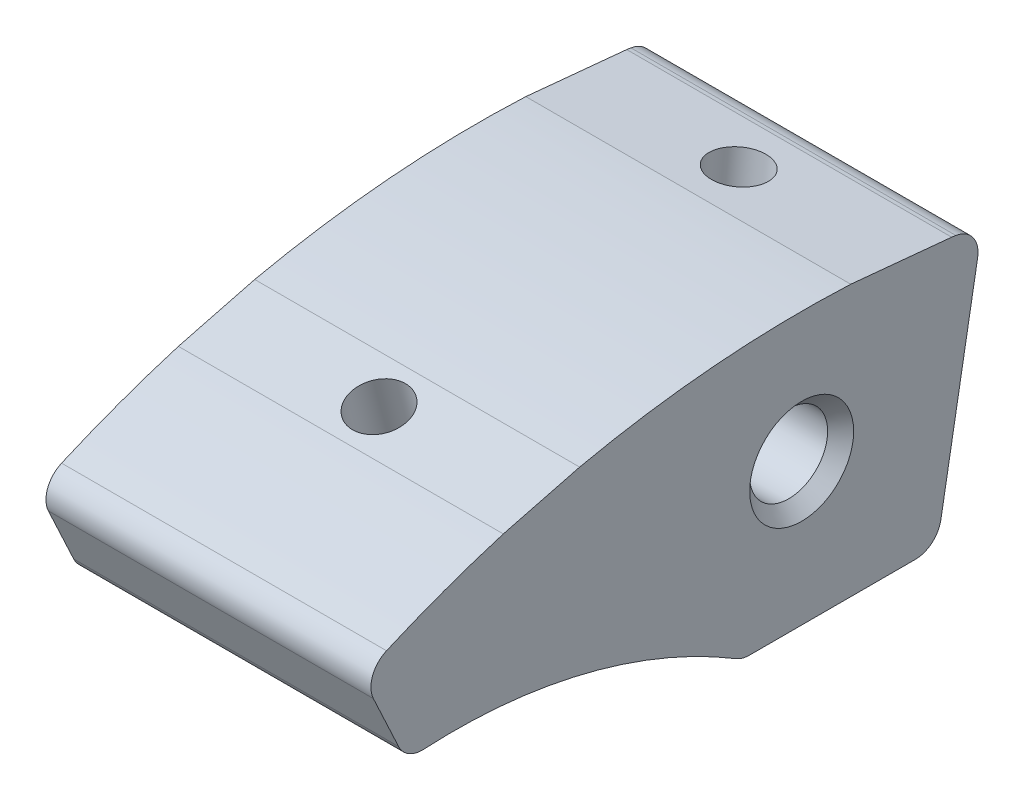
ISO-10303-21;
HEADER;
FILE_DESCRIPTION(('STEP AP214'),'2;1');
FILE_NAME('part.step','',(''),(''),'','','');
FILE_SCHEMA(('AUTOMOTIVE_DESIGN { 1 0 10303 214 1 1 1 1 }'));
ENDSEC;
DATA;
#1=APPLICATION_CONTEXT('core data for automotive mechanical design processes');
#2=APPLICATION_PROTOCOL_DEFINITION('international standard','automotive_design',2000,#1);
#3=PRODUCT_CONTEXT('',#1,'mechanical');
#4=PRODUCT('Part','Part','',(#3));
#5=PRODUCT_RELATED_PRODUCT_CATEGORY('part','',(#4));
#6=PRODUCT_DEFINITION_FORMATION('','',#4);
#7=PRODUCT_DEFINITION_CONTEXT('part definition',#1,'design');
#8=PRODUCT_DEFINITION('design','',#6,#7);
#9=PRODUCT_DEFINITION_SHAPE('','',#8);
#10=(LENGTH_UNIT() NAMED_UNIT(*) SI_UNIT(.MILLI.,.METRE.));
#11=(NAMED_UNIT(*) PLANE_ANGLE_UNIT() SI_UNIT($,.RADIAN.));
#12=(NAMED_UNIT(*) SI_UNIT($,.STERADIAN.) SOLID_ANGLE_UNIT());
#13=UNCERTAINTY_MEASURE_WITH_UNIT(LENGTH_MEASURE(1.E-05),#10,'distance_accuracy_value','');
#14=(GEOMETRIC_REPRESENTATION_CONTEXT(3) GLOBAL_UNCERTAINTY_ASSIGNED_CONTEXT((#13)) GLOBAL_UNIT_ASSIGNED_CONTEXT((#10,
#11,#12)) REPRESENTATION_CONTEXT('',''));
#15=CARTESIAN_POINT('',(0.,0.,0.));
#16=DIRECTION('',(0.,0.,1.));
#17=DIRECTION('',(1.,0.,0.));
#18=AXIS2_PLACEMENT_3D('',#15,#16,#17);
#19=CARTESIAN_POINT('',(25.,9.43689570931383E-13,1.38777878078145E-13));
#20=DIRECTION('',(-1.,0.,0.));
#21=DIRECTION('',(0.,0.,1.));
#22=AXIS2_PLACEMENT_3D('',#19,#20,#21);
#23=CYLINDRICAL_SURFACE('',#22,79.9999999999991);
#24=DIRECTION('',(1.,0.,0.));
#25=VECTOR('',#24,1.);
#26=CARTESIAN_POINT('',(0.,79.9107900744391,-3.77698685183537));
#27=LINE('',#26,#25);
#28=CARTESIAN_POINT('',(0.,79.9107900744391,-3.77698685183537));
#29=VERTEX_POINT('',#28);
#30=CARTESIAN_POINT('',(25.,79.9107900744391,-3.77698685183537));
#31=VERTEX_POINT('',#30);
#32=EDGE_CURVE('E136',#29,#31,#27,.T.);
#33=ORIENTED_EDGE('',*,*,#32,.F.);
#34=CARTESIAN_POINT('',(0.,9.43689570931383E-13,1.38777878078145E-13));
#35=DIRECTION('',(1.,0.,0.));
#36=DIRECTION('',(0.,0.,-1.));
#37=AXIS2_PLACEMENT_3D('',#34,#35,#36);
#38=CIRCLE('',#37,79.9999999999991);
#39=CARTESIAN_POINT('',(0.,78.1554137248355,17.0801436030202));
#40=VERTEX_POINT('',#39);
#41=EDGE_CURVE('E146',#40,#29,#38,.F.);
#42=ORIENTED_EDGE('',*,*,#41,.F.);
#43=DIRECTION('',(1.,0.,0.));
#44=VECTOR('',#43,1.);
#45=CARTESIAN_POINT('',(0.,78.1554137248418,17.0801436029961));
#46=LINE('',#45,#44);
#47=CARTESIAN_POINT('',(25.,78.1554137248418,17.0801436029961));
#48=VERTEX_POINT('',#47);
#49=EDGE_CURVE('E58',#40,#48,#46,.T.);
#50=ORIENTED_EDGE('',*,*,#49,.T.);
#51=CARTESIAN_POINT('',(25.,9.43689570931383E-13,1.38777878078145E-13));
#52=DIRECTION('',(1.,0.,0.));
#53=DIRECTION('',(0.,0.,-1.));
#54=AXIS2_PLACEMENT_3D('',#51,#52,#53);
#55=CIRCLE('',#54,79.9999999999991);
#56=EDGE_CURVE('E148',#48,#31,#55,.F.);
#57=ORIENTED_EDGE('',*,*,#56,.T.);
#58=EDGE_LOOP('',(#33,#42,#50,#57));
#59=FACE_BOUND('',#58,.T.);
#60=ADVANCED_FACE('F35',(#59),#23,.T.);
#61=DIRECTION('',(1.,0.,0.));
#62=VECTOR('',#61,1.);
#63=CARTESIAN_POINT('',(0.,76.6368829973072,22.9518662521603));
#64=LINE('',#63,#62);
#65=CARTESIAN_POINT('',(0.,76.6368829973072,22.9518662521603));
#66=VERTEX_POINT('',#65);
#67=CARTESIAN_POINT('',(25.,76.6368829973072,22.9518662521603));
#68=VERTEX_POINT('',#67);
#69=EDGE_CURVE('E331',#66,#68,#64,.T.);
#70=ORIENTED_EDGE('',*,*,#69,.F.);
#71=CARTESIAN_POINT('',(0.,73.3476937746077,31.9392519941587));
#72=VERTEX_POINT('',#71);
#73=EDGE_CURVE('E153',#72,#66,#38,.F.);
#74=ORIENTED_EDGE('',*,*,#73,.F.);
#75=DIRECTION('',(-1.,0.,0.));
#76=VECTOR('',#75,1.);
#77=CARTESIAN_POINT('',(25.,73.3476937746077,31.9392519941587));
#78=LINE('',#77,#76);
#79=CARTESIAN_POINT('',(25.,73.3476937746077,31.9392519941587));
#80=VERTEX_POINT('',#79);
#81=EDGE_CURVE('E167',#72,#80,#78,.F.);
#82=ORIENTED_EDGE('',*,*,#81,.T.);
#83=EDGE_CURVE('E313',#80,#68,#55,.F.);
#84=ORIENTED_EDGE('',*,*,#83,.T.);
#85=EDGE_LOOP('',(#70,#74,#82,#84));
#86=FACE_BOUND('',#85,.T.);
#87=ADVANCED_FACE('F284',(#86),#23,.T.);
#88=CARTESIAN_POINT('',(25.,59.0884651807326,0.));
#89=DIRECTION('',(0.,1.,0.));
#90=DIRECTION('',(0.,0.,1.));
#91=AXIS2_PLACEMENT_3D('',#88,#89,#90);
#92=PLANE('',#91);
#93=CARTESIAN_POINT('',(6.5,59.0884651807326,0.));
#94=DIRECTION('',(0.,-1.,0.));
#95=DIRECTION('',(0.,0.,-1.));
#96=AXIS2_PLACEMENT_3D('',#93,#94,#95);
#97=CIRCLE('',#96,1.65);
#98=CARTESIAN_POINT('',(6.5,59.0884651807326,-1.65));
#99=VERTEX_POINT('',#98);
#100=EDGE_CURVE('E266',#99,#99,#97,.T.);
#101=ORIENTED_EDGE('',*,*,#100,.F.);
#102=EDGE_LOOP('',(#101));
#103=FACE_BOUND('',#102,.T.);
#104=CARTESIAN_POINT('',(18.5,59.0884651807326,0.));
#105=DIRECTION('',(0.,-1.,0.));
#106=DIRECTION('',(0.,0.,-1.));
#107=AXIS2_PLACEMENT_3D('',#104,#105,#106);
#108=CIRCLE('',#107,1.65);
#109=CARTESIAN_POINT('',(18.5,59.0884651807326,-1.65));
#110=VERTEX_POINT('',#109);
#111=EDGE_CURVE('E265',#110,#110,#108,.T.);
#112=ORIENTED_EDGE('',*,*,#111,.F.);
#113=EDGE_LOOP('',(#112));
#114=FACE_BOUND('',#113,.T.);
#115=CARTESIAN_POINT('',(12.5,59.0884651807326,-5.68957207170575));
#116=DIRECTION('',(0.,1.,0.));
#117=DIRECTION('',(0.,0.,-1.));
#118=AXIS2_PLACEMENT_3D('',#115,#116,#117);
#119=ELLIPSE('',#118,2.10971269876737,2.1);
#120=CARTESIAN_POINT('',(12.5,59.0884651807326,-7.79928477047312));
#121=VERTEX_POINT('',#120);
#122=EDGE_CURVE('E391',#121,#121,#119,.T.);
#123=ORIENTED_EDGE('',*,*,#122,.T.);
#124=EDGE_LOOP('',(#123));
#125=FACE_BOUND('',#124,.T.);
#126=DIRECTION('',(0.,0.,-1.));
#127=VECTOR('',#126,1.);
#128=CARTESIAN_POINT('',(0.,59.0884651807326,0.));
#129=LINE('',#128,#127);
#130=CARTESIAN_POINT('',(0.,59.0884651807326,4.01745601932407));
#131=VERTEX_POINT('',#130);
#132=CARTESIAN_POINT('',(0.,59.0884651807326,-8.74069139766083));
#133=VERTEX_POINT('',#132);
#134=EDGE_CURVE('E325',#131,#133,#129,.T.);
#135=ORIENTED_EDGE('',*,*,#134,.T.);
#136=DIRECTION('',(-1.,0.,0.));
#137=VECTOR('',#136,1.);
#138=CARTESIAN_POINT('',(25.,59.0884651807326,-8.74069139766083));
#139=LINE('',#138,#137);
#140=CARTESIAN_POINT('',(25.,59.0884651807326,-8.74069139766083));
#141=VERTEX_POINT('',#140);
#142=EDGE_CURVE('E202',#133,#141,#139,.F.);
#143=ORIENTED_EDGE('',*,*,#142,.T.);
#144=DIRECTION('',(0.,0.,-1.));
#145=VECTOR('',#144,1.);
#146=CARTESIAN_POINT('',(25.,59.0884651807326,0.));
#147=LINE('',#146,#145);
#148=CARTESIAN_POINT('',(25.,59.0884651807326,4.01745601932407));
#149=VERTEX_POINT('',#148);
#150=EDGE_CURVE('E166',#149,#141,#147,.T.);
#151=ORIENTED_EDGE('',*,*,#150,.F.);
#152=DIRECTION('',(-1.,0.,0.));
#153=VECTOR('',#152,1.);
#154=CARTESIAN_POINT('',(25.,59.0884651807326,4.01745601932407));
#155=LINE('',#154,#153);
#156=EDGE_CURVE('E199',#149,#131,#155,.T.);
#157=ORIENTED_EDGE('',*,*,#156,.T.);
#158=EDGE_LOOP('',(#135,#143,#151,#157));
#159=FACE_BOUND('',#158,.T.);
#160=ADVANCED_FACE('F290',(#103,#114,#125,#159),#92,.F.);
#161=CARTESIAN_POINT('',(25.,0.,0.));
#162=DIRECTION('',(0.,0.173648177666924,0.984807753012209));
#163=DIRECTION('',(0.,-0.984807753012209,0.173648177666924));
#164=AXIS2_PLACEMENT_3D('',#161,#162,#163);
#165=PLANE('',#164);
#166=DIRECTION('',(0.,0.984807753012209,-0.173648177666924));
#167=VECTOR('',#166,1.);
#168=CARTESIAN_POINT('',(0.,0.,0.));
#169=LINE('',#168,#167);
#170=CARTESIAN_POINT('',(0.,60.7411688253987,-10.7103069036853));
#171=VERTEX_POINT('',#170);
#172=CARTESIAN_POINT('',(0.,76.7897491022674,-13.5401046085628));
#173=VERTEX_POINT('',#172);
#174=EDGE_CURVE('E157',#171,#173,#169,.T.);
#175=ORIENTED_EDGE('',*,*,#174,.T.);
#176=DIRECTION('',(1.,0.,0.));
#177=VECTOR('',#176,1.);
#178=CARTESIAN_POINT('',(25.,76.7897491022674,-13.5401046085628));
#179=LINE('',#178,#177);
#180=CARTESIAN_POINT('',(25.,76.7897491022674,-13.5401046085628));
#181=VERTEX_POINT('',#180);
#182=EDGE_CURVE('E186',#173,#181,#179,.T.);
#183=ORIENTED_EDGE('',*,*,#182,.T.);
#184=DIRECTION('',(0.,0.984807753012209,-0.173648177666924));
#185=VECTOR('',#184,1.);
#186=CARTESIAN_POINT('',(25.,0.,0.));
#187=LINE('',#186,#185);
#188=CARTESIAN_POINT('',(25.,60.7411688253987,-10.7103069036853));
#189=VERTEX_POINT('',#188);
#190=EDGE_CURVE('E311',#189,#181,#187,.T.);
#191=ORIENTED_EDGE('',*,*,#190,.F.);
#192=DIRECTION('',(-1.,0.,0.));
#193=VECTOR('',#192,1.);
#194=CARTESIAN_POINT('',(25.,60.7411688253987,-10.7103069036853));
#195=LINE('',#194,#193);
#196=EDGE_CURVE('E183',#189,#171,#195,.T.);
#197=ORIENTED_EDGE('',*,*,#196,.T.);
#198=EDGE_LOOP('',(#175,#183,#191,#197));
#199=FACE_BOUND('',#198,.T.);
#200=ADVANCED_FACE('F295',(#199),#165,.F.);
#201=DIRECTION('',(1.,0.,0.));
#202=VECTOR('',#201,1.);
#203=CARTESIAN_POINT('',(0.,79.1632868545984,-11.5401046085628));
#204=LINE('',#203,#202);
#205=CARTESIAN_POINT('',(0.,79.1632868545983,-11.540104608563));
#206=VERTEX_POINT('',#205);
#207=CARTESIAN_POINT('',(25.,79.1632868545984,-11.5401046085628));
#208=VERTEX_POINT('',#207);
#209=EDGE_CURVE('E50',#206,#208,#204,.T.);
#210=ORIENTED_EDGE('',*,*,#209,.T.);
#211=CARTESIAN_POINT('',(25.,79.1149184180526,-11.8671683102958));
#212=VERTEX_POINT('',#211);
#213=EDGE_CURVE('E304',#208,#212,#55,.F.);
#214=ORIENTED_EDGE('',*,*,#213,.T.);
#215=DIRECTION('',(-1.,0.,0.));
#216=VECTOR('',#215,1.);
#217=CARTESIAN_POINT('',(25.,79.1149184180526,-11.8671683102958));
#218=LINE('',#217,#216);
#219=CARTESIAN_POINT('',(0.,79.1149184180526,-11.8671683102958));
#220=VERTEX_POINT('',#219);
#221=EDGE_CURVE('E169',#212,#220,#218,.T.);
#222=ORIENTED_EDGE('',*,*,#221,.T.);
#223=EDGE_CURVE('E154',#206,#220,#38,.F.);
#224=ORIENTED_EDGE('',*,*,#223,.F.);
#225=EDGE_LOOP('',(#210,#214,#222,#224));
#226=FACE_BOUND('',#225,.T.);
#227=ADVANCED_FACE('F286',(#226),#23,.T.);
#228=CARTESIAN_POINT('',(25.,0.,0.));
#229=DIRECTION('',(0.,0.422618261740701,-0.906307787036649));
#230=DIRECTION('',(0.,0.906307787036649,0.422618261740701));
#231=AXIS2_PLACEMENT_3D('',#228,#229,#230);
#232=PLANE('',#231);
#233=DIRECTION('',(0.,-0.906307787036649,-0.422618261740701));
#234=VECTOR('',#233,1.);
#235=CARTESIAN_POINT('',(0.,0.,0.));
#236=LINE('',#235,#234);
#237=CARTESIAN_POINT('',(0.,70.6687649067611,32.9533862683781));
#238=VERTEX_POINT('',#237);
#239=CARTESIAN_POINT('',(0.,66.5021891783695,31.0104800979463));
#240=VERTEX_POINT('',#239);
#241=EDGE_CURVE('E156',#238,#240,#236,.T.);
#242=ORIENTED_EDGE('',*,*,#241,.T.);
#243=DIRECTION('',(-1.,0.,0.));
#244=VECTOR('',#243,1.);
#245=CARTESIAN_POINT('',(25.,66.5021891783695,31.0104800979463));
#246=LINE('',#245,#244);
#247=CARTESIAN_POINT('',(25.,66.5021891783695,31.0104800979463));
#248=VERTEX_POINT('',#247);
#249=EDGE_CURVE('E212',#240,#248,#246,.F.);
#250=ORIENTED_EDGE('',*,*,#249,.T.);
#251=DIRECTION('',(0.,-0.906307787036649,-0.422618261740701));
#252=VECTOR('',#251,1.);
#253=CARTESIAN_POINT('',(25.,0.,0.));
#254=LINE('',#253,#252);
#255=CARTESIAN_POINT('',(25.,70.6687649067611,32.9533862683781));
#256=VERTEX_POINT('',#255);
#257=EDGE_CURVE('E317',#256,#248,#254,.T.);
#258=ORIENTED_EDGE('',*,*,#257,.F.);
#259=DIRECTION('',(1.,0.,0.));
#260=VECTOR('',#259,1.);
#261=CARTESIAN_POINT('',(0.,70.6687649067611,32.9533862683781));
#262=LINE('',#261,#260);
#263=EDGE_CURVE('E209',#256,#238,#262,.F.);
#264=ORIENTED_EDGE('',*,*,#263,.T.);
#265=EDGE_LOOP('',(#242,#250,#258,#264));
#266=FACE_BOUND('',#265,.T.);
#267=ADVANCED_FACE('F294',(#266),#232,.F.);
#268=CARTESIAN_POINT('',(25.,23.4155873446094,26.7496859043253));
#269=DIRECTION('',(-1.,0.,0.));
#270=DIRECTION('',(0.,0.,1.));
#271=AXIS2_PLACEMENT_3D('',#268,#269,#270);
#272=CYLINDRICAL_SURFACE('',#271,42.);
#273=CARTESIAN_POINT('',(12.5,64.6745876690471,18.8950762877972));
#274=CARTESIAN_POINT('',(12.6094393315182,64.6745870739009,18.8950714110785));
#275=CARTESIAN_POINT('',(12.7189335381572,64.672813664186,18.885740033249));
#276=CARTESIAN_POINT('',(12.93472991413,64.6657566700201,18.8488081463141));
#277=CARTESIAN_POINT('',(13.0410293059264,64.6604701185733,18.8211921951909));
#278=CARTESIAN_POINT('',(13.2471721066846,64.6465182802319,18.7489563745086));
#279=CARTESIAN_POINT('',(13.3470286981123,64.6378601650287,18.7043726019271));
#280=CARTESIAN_POINT('',(13.5380301731132,64.6173492932062,18.5999847763184));
#281=CARTESIAN_POINT('',(13.6291752480357,64.6054966067781,18.5401810577048));
#282=CARTESIAN_POINT('',(13.8038997264899,64.5783550420913,18.4051398194819));
#283=CARTESIAN_POINT('',(13.8870969172363,64.5629593447145,18.3294307522238));
#284=CARTESIAN_POINT('',(14.0406483637016,64.5292880991701,18.1665323023941));
#285=CARTESIAN_POINT('',(14.1109986463563,64.5110116633435,18.079339382601));
#286=CARTESIAN_POINT('',(14.2436855327573,64.4701284087691,17.8876835894324));
#287=CARTESIAN_POINT('',(14.3047198125036,64.4472793346541,17.7823718527168));
#288=CARTESIAN_POINT('',(14.4098249392611,64.3989837538078,17.5641689128812));
#289=CARTESIAN_POINT('',(14.4538883649443,64.3735361168689,17.4512744191187));
#290=CARTESIAN_POINT('',(14.5286161542925,64.3177060732296,17.2085247143884));
#291=CARTESIAN_POINT('',(14.5573753272395,64.2870863090211,17.0781370403656));
#292=CARTESIAN_POINT('',(14.5940521029398,64.2239064838031,16.8149267378082));
#293=CARTESIAN_POINT('',(14.6019611091333,64.1913456281345,16.6821031276525));
#294=CARTESIAN_POINT('',(14.5970107486551,64.1220714471555,16.4054016433393));
#295=CARTESIAN_POINT('',(14.5822560482363,64.0852453192681,16.2615831884702));
#296=CARTESIAN_POINT('',(14.528827568998,64.0111844337932,15.9784772616868));
#297=CARTESIAN_POINT('',(14.490139670587,63.9739494477429,15.8391925155682));
#298=CARTESIAN_POINT('',(14.387884859853,63.8992825407006,15.5652711941607));
#299=CARTESIAN_POINT('',(14.323646694904,63.8618747130132,15.4308766993657));
#300=CARTESIAN_POINT('',(14.1710562238288,63.7896214841715,15.1757968977564));
#301=CARTESIAN_POINT('',(14.0827312029493,63.7547732399153,15.0550962964542));
#302=CARTESIAN_POINT('',(13.9048108012372,63.6966821012832,14.8567588735519));
#303=CARTESIAN_POINT('',(13.8195892250656,63.6725564595395,14.775446765213));
#304=CARTESIAN_POINT('',(13.6362679880914,63.6282608599016,14.627522511629));
#305=CARTESIAN_POINT('',(13.5381751654955,63.6080888156408,14.5609026107716));
#306=CARTESIAN_POINT('',(13.3303990918275,63.5727948750543,14.4451177759624));
#307=CARTESIAN_POINT('',(13.2206446217163,63.5577066701826,14.3960691595911));
#308=CARTESIAN_POINT('',(12.9933107043818,63.5339216926859,14.3190419913357));
#309=CARTESIAN_POINT('',(12.8757373453324,63.5252200093023,14.2910472501821));
#310=CARTESIAN_POINT('',(12.6511964873739,63.515563681524,14.2600053643997));
#311=CARTESIAN_POINT('',(12.5446107616991,63.5138173221801,14.2544083043208));
#312=CARTESIAN_POINT('',(12.3321201118263,63.5160031313416,14.2614245699702));
#313=CARTESIAN_POINT('',(12.2262149790166,63.5199334674165,14.2740320193045));
#314=CARTESIAN_POINT('',(12.023844336716,63.5328333103153,14.3155793302122));
#315=CARTESIAN_POINT('',(11.9271750658427,63.5415276951256,14.3436278569822));
#316=CARTESIAN_POINT('',(11.7397405096699,63.5632288806945,14.4140372379029));
#317=CARTESIAN_POINT('',(11.6489761330443,63.5762363433017,14.4564002886587));
#318=CARTESIAN_POINT('',(11.4701454760453,63.6067434821428,14.5564973259213));
#319=CARTESIAN_POINT('',(11.3825343013127,63.6244584263094,14.614974978787));
#320=CARTESIAN_POINT('',(11.2173374835084,63.6631068806211,14.7437835656992));
#321=CARTESIAN_POINT('',(11.1397561760976,63.6840417741644,14.8141195957566));
#322=CARTESIAN_POINT('',(10.9863162812178,63.7311431411054,14.9741284295432));
#323=CARTESIAN_POINT('',(10.9119383027666,63.7576363191566,15.0651232575578));
#324=CARTESIAN_POINT('',(10.7778068847445,63.8126464213432,15.2567501722988));
#325=CARTESIAN_POINT('',(10.7180613159973,63.8411644240474,15.3573874053968));
#326=CARTESIAN_POINT('',(10.6062618849569,63.9034490486482,15.5806092567474));
#327=CARTESIAN_POINT('',(10.5564821237695,63.9373885579736,15.7042872233921));
#328=CARTESIAN_POINT('',(10.4769720352267,64.0056516091672,15.9578393670645));
#329=CARTESIAN_POINT('',(10.4472520624515,64.039975340087,16.0877167071442));
#330=CARTESIAN_POINT('',(10.4063761030869,64.1113574298911,16.3633285000668));
#331=CARTESIAN_POINT('',(10.3972792018099,64.1483615016258,16.5093871457967));
#332=CARTESIAN_POINT('',(10.4041280713196,64.2206616312968,16.8013920626414));
#333=CARTESIAN_POINT('',(10.420080088177,64.2559572609624,16.9473382966461));
#334=CARTESIAN_POINT('',(10.4776866644053,64.3242479106096,17.236339963643));
#335=CARTESIAN_POINT('',(10.5196034709383,64.3572155848234,17.3793503229611));
#336=CARTESIAN_POINT('',(10.629384082708,64.4195384833255,17.6559477135847));
#337=CARTESIAN_POINT('',(10.6972377267234,64.448895116358,17.7895384109659));
#338=CARTESIAN_POINT('',(10.8521261943876,64.5011474657633,18.0324008862558));
#339=CARTESIAN_POINT('',(10.9373736207876,64.524360273544,18.1427401628288));
#340=CARTESIAN_POINT('',(11.1278103632541,64.5663325631219,18.3457035659179));
#341=CARTESIAN_POINT('',(11.232986046973,64.5850950695995,18.4383397161269));
#342=CARTESIAN_POINT('',(11.447330391046,64.6157607077579,18.5917966171237));
#343=CARTESIAN_POINT('',(11.5546947141765,64.6282003233464,18.6550335938907));
#344=CARTESIAN_POINT('',(11.7795162492137,64.648806161685,18.760656431782));
#345=CARTESIAN_POINT('',(11.8969554136497,64.6569798474468,18.8030786992634));
#346=CARTESIAN_POINT('',(12.0960702110642,64.6667901228533,18.854201583188));
#347=CARTESIAN_POINT('',(12.176049395973,64.6697102445715,18.8694923458445));
#348=CARTESIAN_POINT('',(12.3373423749757,64.6736091377862,18.8899309825159));
#349=CARTESIAN_POINT('',(12.4186560292273,64.6745881114068,18.8950799125604));
#350=CARTESIAN_POINT('',(12.5,64.6745876690471,18.8950762877972));
#351=B_SPLINE_CURVE_WITH_KNOTS('',3,(#273,#274,#275,#276,#277,#278,#279,#280,#281,#282,#283,
#284,#285,#286,#287,#288,#289,#290,#291,#292,#293,#294,#295,#296,#297,#298,#299,#300,#301,#302,
#303,#304,#305,#306,#307,#308,#309,#310,#311,#312,#313,#314,#315,#316,#317,#318,#319,#320,#321,
#322,#323,#324,#325,#326,#327,#328,#329,#330,#331,#332,#333,#334,#335,#336,#337,#338,#339,#340,
#341,#342,#343,#344,#345,#346,#347,#348,#349,#350),.UNSPECIFIED.,.T.,.F.,(4,2,2,2,2,2,2,2,2,2,2,
2,2,2,2,2,2,2,2,2,2,2,2,2,2,2,2,2,2,2,2,2,2,2,2,2,2,2,4),(0.,0.328008842299299,
0.656295054495746,0.983886746583898,1.31147124142959,1.6506561681736,1.98994581503691,
2.35995588540867,2.73012757739055,3.13937118170067,3.54878349148375,3.99434359768032,
4.44016681682342,4.89857070898867,5.35645746941293,5.7156905162151,6.07473347744878,
6.4361111116514,6.79721058145667,7.11578105080766,7.43424870897621,7.73601243801155,
8.03782249461058,8.35698376617671,8.67628254513177,9.0362886682289,9.39648801663559,
9.80750143183248,10.2187268444434,10.669481454445,11.1203484801711,11.5758452804747,
12.0311638143281,12.4528445178989,12.8742377965096,13.2478598992311,13.6208261607672,
13.8646536768181,14.1084558027179),.UNSPECIFIED.);
#352=CARTESIAN_POINT('',(12.5,64.6745876690471,18.8950762877972));
#353=VERTEX_POINT('',#352);
#354=EDGE_CURVE('E215',#353,#353,#351,.T.);
#355=ORIENTED_EDGE('',*,*,#354,.T.);
#356=EDGE_LOOP('',(#355));
#357=FACE_BOUND('',#356,.T.);
#358=CARTESIAN_POINT('',(0.,23.4155873446094,26.7496859043253));
#359=DIRECTION('',(1.,0.,0.));
#360=DIRECTION('',(0.,0.,-1.));
#361=AXIS2_PLACEMENT_3D('',#358,#359,#360);
#362=CIRCLE('',#361,42.);
#363=CARTESIAN_POINT('',(0.,65.3505239583399,29.0865836775299));
#364=VERTEX_POINT('',#363);
#365=CARTESIAN_POINT('',(0.,59.376061642727,5.05073919591503));
#366=VERTEX_POINT('',#365);
#367=EDGE_CURVE('E163',#364,#366,#362,.F.);
#368=ORIENTED_EDGE('',*,*,#367,.T.);
#369=DIRECTION('',(-1.,0.,0.));
#370=VECTOR('',#369,1.);
#371=CARTESIAN_POINT('',(25.,59.376061642727,5.05073919591503));
#372=LINE('',#371,#370);
#373=CARTESIAN_POINT('',(25.,59.376061642727,5.05073919591503));
#374=VERTEX_POINT('',#373);
#375=EDGE_CURVE('E207',#366,#374,#372,.F.);
#376=ORIENTED_EDGE('',*,*,#375,.T.);
#377=CARTESIAN_POINT('',(25.,23.4155873446094,26.7496859043253));
#378=DIRECTION('',(1.,0.,0.));
#379=DIRECTION('',(0.,0.,-1.));
#380=AXIS2_PLACEMENT_3D('',#377,#378,#379);
#381=CIRCLE('',#380,42.);
#382=CARTESIAN_POINT('',(25.,65.3505239583399,29.0865836775299));
#383=VERTEX_POINT('',#382);
#384=EDGE_CURVE('E170',#383,#374,#381,.F.);
#385=ORIENTED_EDGE('',*,*,#384,.F.);
#386=DIRECTION('',(-1.,0.,0.));
#387=VECTOR('',#386,1.);
#388=CARTESIAN_POINT('',(25.,65.3505239583399,29.0865836775299));
#389=LINE('',#388,#387);
#390=EDGE_CURVE('E204',#383,#364,#389,.T.);
#391=ORIENTED_EDGE('',*,*,#390,.T.);
#392=EDGE_LOOP('',(#368,#376,#385,#391));
#393=FACE_BOUND('',#392,.T.);
#394=ADVANCED_FACE('F229',(#357,#393),#272,.F.);
#395=CARTESIAN_POINT('',(25.,70.,0.));
#396=DIRECTION('',(-1.,0.,0.));
#397=DIRECTION('',(0.,0.,1.));
#398=AXIS2_PLACEMENT_3D('',#395,#396,#397);
#399=CYLINDRICAL_SURFACE('',#398,3.);
#400=CARTESIAN_POINT('',(24.,70.,0.));
#401=DIRECTION('',(1.,0.,0.));
#402=DIRECTION('',(0.,0.,-1.));
#403=AXIS2_PLACEMENT_3D('',#400,#401,#402);
#404=CIRCLE('',#403,3.);
#405=CARTESIAN_POINT('',(24.,70.,-3.));
#406=VERTEX_POINT('',#405);
#407=EDGE_CURVE('E379',#406,#406,#404,.T.);
#408=ORIENTED_EDGE('',*,*,#407,.T.);
#409=EDGE_LOOP('',(#408));
#410=FACE_BOUND('',#409,.T.);
#411=CARTESIAN_POINT('',(1.00000000000001,70.,0.));
#412=DIRECTION('',(1.,0.,0.));
#413=DIRECTION('',(0.,0.,-1.));
#414=AXIS2_PLACEMENT_3D('',#411,#412,#413);
#415=CIRCLE('',#414,3.);
#416=CARTESIAN_POINT('',(1.00000000000001,70.,-3.));
#417=VERTEX_POINT('',#416);
#418=EDGE_CURVE('E214',#417,#417,#415,.F.);
#419=ORIENTED_EDGE('',*,*,#418,.T.);
#420=EDGE_LOOP('',(#419));
#421=FACE_BOUND('',#420,.T.);
#422=CARTESIAN_POINT('',(6.5,67.4945060367265,-1.65));
#423=CARTESIAN_POINT('',(6.41543775587579,67.4944970927085,-1.64999358115515));
#424=CARTESIAN_POINT('',(6.33080158035625,67.4901572169536,-1.64345412095508));
#425=CARTESIAN_POINT('',(6.1642419893439,67.4734769452791,-1.61768357796128));
#426=CARTESIAN_POINT('',(6.08232339226292,67.4611230618666,-1.59843109830519));
#427=CARTESIAN_POINT('',(5.92394184165836,67.4303048557594,-1.54839133504121));
#428=CARTESIAN_POINT('',(5.84744833636022,67.4118787174623,-1.51767597794515));
#429=CARTESIAN_POINT('',(5.70072925067674,67.3710542603929,-1.44580368027316));
#430=CARTESIAN_POINT('',(5.63050498062124,67.3486551141326,-1.40464456372702));
#431=CARTESIAN_POINT('',(5.49050697951391,67.2996577283051,-1.30818987552103));
#432=CARTESIAN_POINT('',(5.42149614307966,67.2728638970716,-1.25188597568528));
#433=CARTESIAN_POINT('',(5.29328457524385,67.2196659787767,-1.12882249865068));
#434=CARTESIAN_POINT('',(5.23408972055438,67.1932621337497,-1.06205670422282));
#435=CARTESIAN_POINT('',(5.12218721247504,67.1411174466604,-0.912984038802342));
#436=CARTESIAN_POINT('',(5.07047291087438,67.1156281712767,-0.829835009326252));
#437=CARTESIAN_POINT('',(4.98212209381967,67.0708362253522,-0.654349556397893));
#438=CARTESIAN_POINT('',(4.94547408910425,67.0515288431158,-0.562020200659685));
#439=CARTESIAN_POINT('',(4.89150601520038,67.0227061766961,-0.378922854343172));
#440=CARTESIAN_POINT('',(4.87283185672805,67.0125099937944,-0.288663762188309));
#441=CARTESIAN_POINT('',(4.85082522164806,67.0004687978247,-0.105768848971926));
#442=CARTESIAN_POINT('',(4.84748111400143,66.998617453475,-0.0131348834272889));
#443=CARTESIAN_POINT('',(4.8558401237369,67.0032087361629,0.161456942743376));
#444=CARTESIAN_POINT('',(4.86600430103804,67.0088031941174,0.243517036042414));
#445=CARTESIAN_POINT('',(4.89825613933328,67.0262986090936,0.404548934713676));
#446=CARTESIAN_POINT('',(4.92034471597395,67.0382000504126,0.483520502425805));
#447=CARTESIAN_POINT('',(4.97581759545011,67.0674120786671,0.637279429786404));
#448=CARTESIAN_POINT('',(5.00932095125488,67.0847795226245,0.712012587065489));
#449=CARTESIAN_POINT('',(5.08643144614225,67.1234457806058,0.854941741305334));
#450=CARTESIAN_POINT('',(5.13004181718505,67.1447458517375,0.923135637298116));
#451=CARTESIAN_POINT('',(5.23148475004153,67.1920818561756,1.05891717191853));
#452=CARTESIAN_POINT('',(5.29034393087261,67.2183807982747,1.12564617195585));
#453=CARTESIAN_POINT('',(5.41792420544975,67.2714436200022,1.24879377983835));
#454=CARTESIAN_POINT('',(5.48665544125848,67.2982079525861,1.30520164705459));
#455=CARTESIAN_POINT('',(5.63929795422943,67.3518373925862,1.41104757147093));
#456=CARTESIAN_POINT('',(5.72401217497651,67.3785050644247,1.45943898084593));
#457=CARTESIAN_POINT('',(5.9020876587557,67.4255733054519,1.54096072440202));
#458=CARTESIAN_POINT('',(5.99543877389512,67.4459811109337,1.57410870202277));
#459=CARTESIAN_POINT('',(6.18038243391405,67.4757113111463,1.62132480747599));
#460=CARTESIAN_POINT('',(6.27150770718116,67.4857961182424,1.63671808149072));
#461=CARTESIAN_POINT('',(6.45556143260455,67.4957886771607,1.65197600548299));
#462=CARTESIAN_POINT('',(6.5484877010052,67.4957080667144,1.65185841284551));
#463=CARTESIAN_POINT('',(6.71898069677553,67.4861870836422,1.63731066997579));
#464=CARTESIAN_POINT('',(6.79681676278818,67.4781088171923,1.6249632757909));
#465=CARTESIAN_POINT('',(6.9490948427084,67.4556910168377,1.58963092545287));
#466=CARTESIAN_POINT('',(7.02353535119722,67.4413487350182,1.56664130047228));
#467=CARTESIAN_POINT('',(7.1705684143407,67.4073529894704,1.50974087534156));
#468=CARTESIAN_POINT('',(7.24295082069504,67.3875011380415,1.47541058671724));
#469=CARTESIAN_POINT('',(7.38136153298298,67.3448247437182,1.39715088074391));
#470=CARTESIAN_POINT('',(7.44738667198258,67.3219987324048,1.35321671440463));
#471=CARTESIAN_POINT('',(7.58217598283305,67.2716125401974,1.24890384728535));
#472=CARTESIAN_POINT('',(7.64971665545364,67.2438752878946,1.18702256034847));
#473=CARTESIAN_POINT('',(7.77394463458245,67.1897853352271,1.05259034248067));
#474=CARTESIAN_POINT('',(7.83062557660594,67.1634334533005,0.980033198593373));
#475=CARTESIAN_POINT('',(7.93418356477834,67.1134411382566,0.82159143201762));
#476=CARTESIAN_POINT('',(7.98041980778174,67.0900052371511,0.735218364495386));
#477=CARTESIAN_POINT('',(8.05721430537587,67.0501977510137,0.554269536180262));
#478=CARTESIAN_POINT('',(8.08778886056153,67.0338188239571,0.459702424085389));
#479=CARTESIAN_POINT('',(8.12930611839183,67.0113767493202,0.275417797995452));
#480=CARTESIAN_POINT('',(8.14193096934435,67.0044329456757,0.186187129425334));
#481=CARTESIAN_POINT('',(8.15243189343455,66.9986656314135,0.00661676308886215));
#482=CARTESIAN_POINT('',(8.15031573581962,66.9998378432486,-0.0837223254250961));
#483=CARTESIAN_POINT('',(8.13233007153813,67.0096895757247,-0.254358366297033));
#484=CARTESIAN_POINT('',(8.11770633320566,67.0176889532817,-0.334831363047834));
#485=CARTESIAN_POINT('',(8.07703517800952,67.0395529897462,-0.491985833876878));
#486=CARTESIAN_POINT('',(8.05098639804465,67.0534183485064,-0.568666854326147));
#487=CARTESIAN_POINT('',(7.98738736796038,67.0864012481456,-0.719080279481093));
#488=CARTESIAN_POINT('',(7.94947440595497,67.1056821205907,-0.792622296205404));
#489=CARTESIAN_POINT('',(7.86367449851232,67.1476834938521,-0.932542405269456));
#490=CARTESIAN_POINT('',(7.81578351940048,67.1704053847034,-0.998917583844721));
#491=CARTESIAN_POINT('',(7.70507399834962,67.2202548287498,-1.13072210629174));
#492=CARTESIAN_POINT('',(7.64117216627433,67.2475885405918,-1.19516495605846));
#493=CARTESIAN_POINT('',(7.50349286244808,67.3017612146295,-1.31290440702821));
#494=CARTESIAN_POINT('',(7.42970353472665,67.3285995381584,-1.36618742691371));
#495=CARTESIAN_POINT('',(7.26827599994856,67.3805489191107,-1.46345962344263));
#496=CARTESIAN_POINT('',(7.18004360140735,67.4054270091039,-1.50659692748028));
#497=CARTESIAN_POINT('',(6.99582119959132,67.4474711441571,-1.57680093269354));
#498=CARTESIAN_POINT('',(6.89985704717183,67.4646617246324,-1.60391885150154));
#499=CARTESIAN_POINT('',(6.75219121694154,67.4823307458679,-1.6313948659609));
#500=CARTESIAN_POINT('',(6.70212523584003,67.4868693738686,-1.63835444049929));
#501=CARTESIAN_POINT('',(6.60138168759252,67.4929596676353,-1.64765888075615));
#502=CARTESIAN_POINT('',(6.55070413403086,67.4945113996244,-1.65000384878586));
#503=CARTESIAN_POINT('',(6.5,67.4945060367265,-1.65));
#504=B_SPLINE_CURVE_WITH_KNOTS('',3,(#422,#423,#424,#425,#426,#427,#428,#429,#430,#431,#432,
#433,#434,#435,#436,#437,#438,#439,#440,#441,#442,#443,#444,#445,#446,#447,#448,#449,#450,#451,
#452,#453,#454,#455,#456,#457,#458,#459,#460,#461,#462,#463,#464,#465,#466,#467,#468,#469,#470,
#471,#472,#473,#474,#475,#476,#477,#478,#479,#480,#481,#482,#483,#484,#485,#486,#487,#488,#489,
#490,#491,#492,#493,#494,#495,#496,#497,#498,#499,#500,#501,#502,#503),.UNSPECIFIED.,.T.,.F.,(4,
2,2,2,2,2,2,2,2,2,2,2,2,2,2,2,2,2,2,2,2,2,2,2,2,2,2,2,2,2,2,2,2,2,2,2,2,2,2,2,4),(0.,
0.253471464978917,0.507370630471962,0.759702723718412,1.0120874338999,1.28998079678324,
1.56803993512379,1.86997289364919,2.17167517502775,2.44828286528195,2.72468065617497,
2.97213663093979,3.21961160997027,3.46975098230537,3.71997045333204,3.99717687977863,
4.27467015892955,4.57652503396565,4.87802964361059,5.15517475627461,5.43200258623577,
5.66859462056207,5.90529054812098,6.15196333618107,6.39875837770522,6.68465599353129,
6.97072065421033,7.27125286686231,7.57147164850532,7.84111747203331,8.11062118950829,
8.35604451303952,8.60149712555497,8.85533990697404,9.10928550569673,9.39243346006446,
9.67592402360686,9.97823556729931,10.2795752459721,10.4315619419379,10.5835452681421),.UNSPECIFIED.);
#505=CARTESIAN_POINT('',(6.5,67.4945060367265,-1.65));
#506=VERTEX_POINT('',#505);
#507=EDGE_CURVE('E259',#506,#506,#504,.T.);
#508=ORIENTED_EDGE('',*,*,#507,.F.);
#509=EDGE_LOOP('',(#508));
#510=FACE_BOUND('',#509,.T.);
#511=CARTESIAN_POINT('',(18.5,67.4945060367265,-1.65));
#512=CARTESIAN_POINT('',(18.4154377558758,67.4944970927085,-1.64999358115515));
#513=CARTESIAN_POINT('',(18.3308015803563,67.4901572169536,-1.64345412095508));
#514=CARTESIAN_POINT('',(18.1642419893439,67.4734769452791,-1.61768357796128));
#515=CARTESIAN_POINT('',(18.0823233922629,67.4611230618666,-1.59843109830519));
#516=CARTESIAN_POINT('',(17.9239418416584,67.4303048557594,-1.54839133504121));
#517=CARTESIAN_POINT('',(17.8474483363602,67.4118787174623,-1.51767597794515));
#518=CARTESIAN_POINT('',(17.7007292506767,67.3710542603929,-1.44580368027316));
#519=CARTESIAN_POINT('',(17.6305049806212,67.3486551141326,-1.40464456372702));
#520=CARTESIAN_POINT('',(17.4905069795139,67.2996577283051,-1.30818987552103));
#521=CARTESIAN_POINT('',(17.4214961430797,67.2728638970716,-1.25188597568528));
#522=CARTESIAN_POINT('',(17.2932845752438,67.2196659787767,-1.12882249865068));
#523=CARTESIAN_POINT('',(17.2340897205544,67.1932621337497,-1.06205670422282));
#524=CARTESIAN_POINT('',(17.122187212475,67.1411174466604,-0.912984038802344));
#525=CARTESIAN_POINT('',(17.0704729108744,67.1156281712767,-0.829835009326255));
#526=CARTESIAN_POINT('',(16.9821220938197,67.0708362253522,-0.654349556397895));
#527=CARTESIAN_POINT('',(16.9454740891042,67.0515288431158,-0.562020200659686));
#528=CARTESIAN_POINT('',(16.8915060152004,67.0227061766961,-0.378922854343174));
#529=CARTESIAN_POINT('',(16.8728318567281,67.0125099937944,-0.288663762188311));
#530=CARTESIAN_POINT('',(16.8508252216481,67.0004687978247,-0.105768848971927));
#531=CARTESIAN_POINT('',(16.8474811140014,66.998617453475,-0.0131348834272904));
#532=CARTESIAN_POINT('',(16.8558401237369,67.0032087361629,0.161456942743374));
#533=CARTESIAN_POINT('',(16.866004301038,67.0088031941174,0.243517036042412));
#534=CARTESIAN_POINT('',(16.8982561393333,67.0262986090936,0.404548934713675));
#535=CARTESIAN_POINT('',(16.920344715974,67.0382000504126,0.483520502425803));
#536=CARTESIAN_POINT('',(16.9758175954501,67.0674120786671,0.637279429786403));
#537=CARTESIAN_POINT('',(17.0093209512549,67.0847795226245,0.712012587065488));
#538=CARTESIAN_POINT('',(17.0864314461423,67.1234457806058,0.854941741305333));
#539=CARTESIAN_POINT('',(17.130041817185,67.1447458517376,0.923135637298114));
#540=CARTESIAN_POINT('',(17.2314847500415,67.1920818561756,1.05891717191852));
#541=CARTESIAN_POINT('',(17.2903439308726,67.2183807982746,1.12564617195585));
#542=CARTESIAN_POINT('',(17.4179242054498,67.2714436200022,1.24879377983835));
#543=CARTESIAN_POINT('',(17.4866554412585,67.2982079525861,1.30520164705459));
#544=CARTESIAN_POINT('',(17.6392979542294,67.3518373925862,1.41104757147092));
#545=CARTESIAN_POINT('',(17.7240121749765,67.3785050644247,1.45943898084593));
#546=CARTESIAN_POINT('',(17.9020876587557,67.4255733054519,1.54096072440201));
#547=CARTESIAN_POINT('',(17.9954387738951,67.4459811109337,1.57410870202277));
#548=CARTESIAN_POINT('',(18.180382433914,67.4757113111463,1.62132480747599));
#549=CARTESIAN_POINT('',(18.2715077071812,67.4857961182424,1.63671808149072));
#550=CARTESIAN_POINT('',(18.4555614326045,67.4957886771607,1.65197600548299));
#551=CARTESIAN_POINT('',(18.5484877010052,67.4957080667144,1.65185841284551));
#552=CARTESIAN_POINT('',(18.7189806967755,67.4861870836422,1.63731066997579));
#553=CARTESIAN_POINT('',(18.7968167627882,67.4781088171923,1.6249632757909));
#554=CARTESIAN_POINT('',(18.9490948427084,67.4556910168377,1.58963092545288));
#555=CARTESIAN_POINT('',(19.0235353511972,67.4413487350182,1.56664130047228));
#556=CARTESIAN_POINT('',(19.1705684143407,67.4073529894704,1.50974087534156));
#557=CARTESIAN_POINT('',(19.242950820695,67.3875011380415,1.47541058671725));
#558=CARTESIAN_POINT('',(19.381361532983,67.3448247437182,1.39715088074391));
#559=CARTESIAN_POINT('',(19.4473866719826,67.3219987324048,1.35321671440463));
#560=CARTESIAN_POINT('',(19.582175982833,67.2716125401974,1.24890384728535));
#561=CARTESIAN_POINT('',(19.6497166554536,67.2438752878946,1.18702256034847));
#562=CARTESIAN_POINT('',(19.7739446345824,67.1897853352271,1.05259034248068));
#563=CARTESIAN_POINT('',(19.8306255766059,67.1634334533005,0.980033198593374));
#564=CARTESIAN_POINT('',(19.9341835647783,67.1134411382566,0.821591432017619));
#565=CARTESIAN_POINT('',(19.9804198077817,67.0900052371511,0.735218364495384));
#566=CARTESIAN_POINT('',(20.0572143053759,67.0501977510137,0.55426953618026));
#567=CARTESIAN_POINT('',(20.0877888605615,67.0338188239571,0.459702424085389));
#568=CARTESIAN_POINT('',(20.1293061183918,67.0113767493202,0.275417797995454));
#569=CARTESIAN_POINT('',(20.1419309693443,67.0044329456757,0.186187129425336));
#570=CARTESIAN_POINT('',(20.1524318934345,66.9986656314135,0.00661676308886413));
#571=CARTESIAN_POINT('',(20.1503157358196,66.9998378432486,-0.0837223254250942));
#572=CARTESIAN_POINT('',(20.1323300715381,67.0096895757247,-0.254358366297032));
#573=CARTESIAN_POINT('',(20.1177063332057,67.0176889532817,-0.334831363047833));
#574=CARTESIAN_POINT('',(20.0770351780095,67.0395529897462,-0.491985833876876));
#575=CARTESIAN_POINT('',(20.0509863980447,67.0534183485064,-0.568666854326145));
#576=CARTESIAN_POINT('',(19.9873873679604,67.0864012481456,-0.719080279481091));
#577=CARTESIAN_POINT('',(19.949474405955,67.1056821205907,-0.792622296205401));
#578=CARTESIAN_POINT('',(19.8636744985123,67.1476834938521,-0.932542405269454));
#579=CARTESIAN_POINT('',(19.8157835194005,67.1704053847034,-0.998917583844718));
#580=CARTESIAN_POINT('',(19.7050739983496,67.2202548287498,-1.13072210629174));
#581=CARTESIAN_POINT('',(19.6411721662743,67.2475885405918,-1.19516495605846));
#582=CARTESIAN_POINT('',(19.5034928624481,67.3017612146295,-1.31290440702821));
#583=CARTESIAN_POINT('',(19.4297035347267,67.3285995381584,-1.36618742691371));
#584=CARTESIAN_POINT('',(19.2682759999486,67.3805489191107,-1.46345962344263));
#585=CARTESIAN_POINT('',(19.1800436014073,67.4054270091039,-1.50659692748028));
#586=CARTESIAN_POINT('',(18.9958211995913,67.4474711441571,-1.57680093269354));
#587=CARTESIAN_POINT('',(18.8998570471718,67.4646617246324,-1.60391885150154));
#588=CARTESIAN_POINT('',(18.7521912169415,67.4823307458679,-1.6313948659609));
#589=CARTESIAN_POINT('',(18.70212523584,67.4868693738686,-1.63835444049929));
#590=CARTESIAN_POINT('',(18.6013816875925,67.4929596676353,-1.64765888075615));
#591=CARTESIAN_POINT('',(18.5507041340309,67.4945113996244,-1.65000384878586));
#592=CARTESIAN_POINT('',(18.5,67.4945060367265,-1.65));
#593=B_SPLINE_CURVE_WITH_KNOTS('',3,(#511,#512,#513,#514,#515,#516,#517,#518,#519,#520,#521,
#522,#523,#524,#525,#526,#527,#528,#529,#530,#531,#532,#533,#534,#535,#536,#537,#538,#539,#540,
#541,#542,#543,#544,#545,#546,#547,#548,#549,#550,#551,#552,#553,#554,#555,#556,#557,#558,#559,
#560,#561,#562,#563,#564,#565,#566,#567,#568,#569,#570,#571,#572,#573,#574,#575,#576,#577,#578,
#579,#580,#581,#582,#583,#584,#585,#586,#587,#588,#589,#590,#591,#592),.UNSPECIFIED.,.T.,.F.,(4,
2,2,2,2,2,2,2,2,2,2,2,2,2,2,2,2,2,2,2,2,2,2,2,2,2,2,2,2,2,2,2,2,2,2,2,2,2,2,2,4),(0.,
0.253471464978918,0.507370630471961,0.759702723718414,1.0120874338999,1.28998079678324,
1.56803993512379,1.86997289364919,2.17167517502775,2.44828286528195,2.72468065617497,
2.97213663093979,3.21961160997027,3.46975098230537,3.71997045333204,3.99717687977862,
4.27467015892955,4.57652503396565,4.8780296436106,5.15517475627461,5.43200258623578,
5.66859462056206,5.90529054812098,6.15196333618107,6.39875837770522,6.6846559935313,
6.97072065421033,7.27125286686232,7.57147164850533,7.84111747203332,8.11062118950829,
8.35604451303953,8.60149712555497,8.85533990697405,9.10928550569673,9.39243346006447,
9.67592402360686,9.97823556729932,10.2795752459721,10.4315619419379,10.5835452681421),.UNSPECIFIED.);
#594=CARTESIAN_POINT('',(18.5,67.4945060367265,-1.65));
#595=VERTEX_POINT('',#594);
#596=EDGE_CURVE('E223',#595,#595,#593,.T.);
#597=ORIENTED_EDGE('',*,*,#596,.F.);
#598=EDGE_LOOP('',(#597));
#599=FACE_BOUND('',#598,.T.);
#600=ADVANCED_FACE('F250',(#410,#421,#510,#599),#399,.F.);
#601=CARTESIAN_POINT('',(25.,0.,0.));
#602=DIRECTION('',(1.,0.,0.));
#603=DIRECTION('',(0.,0.,-1.));
#604=AXIS2_PLACEMENT_3D('',#601,#602,#603);
#605=PLANE('',#604);
#606=CARTESIAN_POINT('',(25.,70.,0.));
#607=DIRECTION('',(1.,0.,0.));
#608=DIRECTION('',(0.,0.,-1.));
#609=AXIS2_PLACEMENT_3D('',#606,#607,#608);
#610=CIRCLE('',#609,4.00000000000001);
#611=CARTESIAN_POINT('',(25.,70.,-4.00000000000001));
#612=VERTEX_POINT('',#611);
#613=EDGE_CURVE('E43',#612,#612,#610,.F.);
#614=ORIENTED_EDGE('',*,*,#613,.T.);
#615=EDGE_LOOP('',(#614));
#616=FACE_BOUND('',#615,.T.);
#617=DIRECTION('',(0.,-0.0958457525202258,-0.995396198367179));
#618=VECTOR('',#617,1.);
#619=CARTESIAN_POINT('',(25.,79.9107900744391,-3.77698685183537));
#620=LINE('',#619,#618);
#621=EDGE_CURVE('E141',#31,#208,#620,.T.);
#622=ORIENTED_EDGE('',*,*,#621,.F.);
#623=ORIENTED_EDGE('',*,*,#56,.F.);
#624=DIRECTION('',(0.,0.250380004054443,-0.968147640378107));
#625=VECTOR('',#624,1.);
#626=CARTESIAN_POINT('',(25.,76.6368829973072,22.9518662521603));
#627=LINE('',#626,#625);
#628=EDGE_CURVE('E305',#68,#48,#627,.T.);
#629=ORIENTED_EDGE('',*,*,#628,.F.);
#630=ORIENTED_EDGE('',*,*,#83,.F.);
#631=CARTESIAN_POINT('',(25.,71.5140014302425,31.1407706943048));
#632=DIRECTION('',(1.,0.,0.));
#633=DIRECTION('',(0.,0.,-1.));
#634=AXIS2_PLACEMENT_3D('',#631,#632,#633);
#635=CIRCLE('',#634,2.);
#636=EDGE_CURVE('E188',#80,#256,#635,.T.);
#637=ORIENTED_EDGE('',*,*,#636,.T.);
#638=ORIENTED_EDGE('',*,*,#257,.T.);
#639=CARTESIAN_POINT('',(25.,67.3474257018509,29.197864523873));
#640=DIRECTION('',(1.,0.,0.));
#641=DIRECTION('',(0.,0.,-1.));
#642=AXIS2_PLACEMENT_3D('',#639,#640,#641);
#643=CIRCLE('',#642,2.);
#644=EDGE_CURVE('E190',#248,#383,#643,.T.);
#645=ORIENTED_EDGE('',*,*,#644,.T.);
#646=ORIENTED_EDGE('',*,*,#384,.T.);
#647=CARTESIAN_POINT('',(25.,61.0884651807326,4.01745601932407));
#648=DIRECTION('',(1.,0.,0.));
#649=DIRECTION('',(0.,0.,-1.));
#650=AXIS2_PLACEMENT_3D('',#647,#648,#649);
#651=CIRCLE('',#650,2.);
#652=EDGE_CURVE('E192',#374,#149,#651,.T.);
#653=ORIENTED_EDGE('',*,*,#652,.T.);
#654=ORIENTED_EDGE('',*,*,#150,.T.);
#655=CARTESIAN_POINT('',(25.,61.0884651807326,-8.74069139766083));
#656=DIRECTION('',(1.,0.,0.));
#657=DIRECTION('',(0.,0.,-1.));
#658=AXIS2_PLACEMENT_3D('',#655,#656,#657);
#659=CIRCLE('',#658,2.);
#660=EDGE_CURVE('E194',#141,#189,#659,.T.);
#661=ORIENTED_EDGE('',*,*,#660,.T.);
#662=ORIENTED_EDGE('',*,*,#190,.T.);
#663=CARTESIAN_POINT('',(25.,77.1370454576012,-11.5704891025384));
#664=DIRECTION('',(1.,0.,0.));
#665=DIRECTION('',(0.,0.,-1.));
#666=AXIS2_PLACEMENT_3D('',#663,#664,#665);
#667=CIRCLE('',#666,2.);
#668=EDGE_CURVE('E196',#181,#212,#667,.T.);
#669=ORIENTED_EDGE('',*,*,#668,.T.);
#670=ORIENTED_EDGE('',*,*,#213,.F.);
#671=EDGE_LOOP('',(#622,#623,#629,#630,#637,#638,#645,#646,#653,#654,#661,#662,#669,#670));
#672=FACE_BOUND('',#671,.T.);
#673=ADVANCED_FACE('F247',(#616,#672),#605,.T.);
#674=CARTESIAN_POINT('',(0.,0.,0.));
#675=DIRECTION('',(1.,0.,0.));
#676=DIRECTION('',(0.,0.,-1.));
#677=AXIS2_PLACEMENT_3D('',#674,#675,#676);
#678=PLANE('',#677);
#679=CARTESIAN_POINT('',(0.,70.,0.));
#680=DIRECTION('',(1.,0.,0.));
#681=DIRECTION('',(0.,0.,-1.));
#682=AXIS2_PLACEMENT_3D('',#679,#680,#681);
#683=CIRCLE('',#682,4.);
#684=CARTESIAN_POINT('',(0.,70.,-4.));
#685=VERTEX_POINT('',#684);
#686=EDGE_CURVE('E11',#685,#685,#683,.T.);
#687=ORIENTED_EDGE('',*,*,#686,.T.);
#688=EDGE_LOOP('',(#687));
#689=FACE_BOUND('',#688,.T.);
#690=ORIENTED_EDGE('',*,*,#41,.T.);
#691=DIRECTION('',(0.,-0.0958457525202258,-0.995396198367179));
#692=VECTOR('',#691,1.);
#693=CARTESIAN_POINT('',(0.,79.9107900744391,-3.77698685183537));
#694=LINE('',#693,#692);
#695=EDGE_CURVE('E133',#29,#206,#694,.T.);
#696=ORIENTED_EDGE('',*,*,#695,.T.);
#697=ORIENTED_EDGE('',*,*,#223,.T.);
#698=CARTESIAN_POINT('',(0.,77.1370454576012,-11.5704891025384));
#699=DIRECTION('',(1.,0.,0.));
#700=DIRECTION('',(0.,0.,-1.));
#701=AXIS2_PLACEMENT_3D('',#698,#699,#700);
#702=CIRCLE('',#701,2.);
#703=EDGE_CURVE('E181',#220,#173,#702,.F.);
#704=ORIENTED_EDGE('',*,*,#703,.T.);
#705=ORIENTED_EDGE('',*,*,#174,.F.);
#706=CARTESIAN_POINT('',(0.,61.0884651807326,-8.74069139766083));
#707=DIRECTION('',(1.,0.,0.));
#708=DIRECTION('',(0.,0.,-1.));
#709=AXIS2_PLACEMENT_3D('',#706,#707,#708);
#710=CIRCLE('',#709,2.);
#711=EDGE_CURVE('E179',#171,#133,#710,.F.);
#712=ORIENTED_EDGE('',*,*,#711,.T.);
#713=ORIENTED_EDGE('',*,*,#134,.F.);
#714=CARTESIAN_POINT('',(0.,61.0884651807326,4.01745601932407));
#715=DIRECTION('',(1.,0.,0.));
#716=DIRECTION('',(0.,0.,-1.));
#717=AXIS2_PLACEMENT_3D('',#714,#715,#716);
#718=CIRCLE('',#717,2.);
#719=EDGE_CURVE('E177',#131,#366,#718,.F.);
#720=ORIENTED_EDGE('',*,*,#719,.T.);
#721=ORIENTED_EDGE('',*,*,#367,.F.);
#722=CARTESIAN_POINT('',(0.,67.3474257018509,29.197864523873));
#723=DIRECTION('',(1.,0.,0.));
#724=DIRECTION('',(0.,0.,-1.));
#725=AXIS2_PLACEMENT_3D('',#722,#723,#724);
#726=CIRCLE('',#725,2.);
#727=EDGE_CURVE('E175',#364,#240,#726,.F.);
#728=ORIENTED_EDGE('',*,*,#727,.T.);
#729=ORIENTED_EDGE('',*,*,#241,.F.);
#730=CARTESIAN_POINT('',(0.,71.5140014302425,31.1407706943048));
#731=DIRECTION('',(1.,0.,0.));
#732=DIRECTION('',(0.,0.,-1.));
#733=AXIS2_PLACEMENT_3D('',#730,#731,#732);
#734=CIRCLE('',#733,2.);
#735=EDGE_CURVE('E173',#238,#72,#734,.F.);
#736=ORIENTED_EDGE('',*,*,#735,.T.);
#737=ORIENTED_EDGE('',*,*,#73,.T.);
#738=DIRECTION('',(0.,0.250380004054443,-0.968147640378107));
#739=VECTOR('',#738,1.);
#740=CARTESIAN_POINT('',(0.,76.6368829973072,22.9518662521603));
#741=LINE('',#740,#739);
#742=EDGE_CURVE('E152',#66,#40,#741,.T.);
#743=ORIENTED_EDGE('',*,*,#742,.T.);
#744=EDGE_LOOP('',(#690,#696,#697,#704,#705,#712,#713,#720,#721,#728,#729,#736,#737,#743));
#745=FACE_BOUND('',#744,.T.);
#746=ADVANCED_FACE('F150',(#689,#745),#678,.F.);
#747=CARTESIAN_POINT('',(25.,77.1370454576012,-11.5704891025384));
#748=DIRECTION('',(-1.,0.,0.));
#749=DIRECTION('',(0.,0.,1.));
#750=AXIS2_PLACEMENT_3D('',#747,#748,#749);
#751=CYLINDRICAL_SURFACE('',#750,2.);
#752=ORIENTED_EDGE('',*,*,#668,.F.);
#753=ORIENTED_EDGE('',*,*,#182,.F.);
#754=ORIENTED_EDGE('',*,*,#703,.F.);
#755=ORIENTED_EDGE('',*,*,#221,.F.);
#756=EDGE_LOOP('',(#752,#753,#754,#755));
#757=FACE_BOUND('',#756,.T.);
#758=ADVANCED_FACE('F253',(#757),#751,.T.);
#759=CARTESIAN_POINT('',(25.,61.0884651807326,-8.74069139766083));
#760=DIRECTION('',(-1.,0.,0.));
#761=DIRECTION('',(0.,0.,1.));
#762=AXIS2_PLACEMENT_3D('',#759,#760,#761);
#763=CYLINDRICAL_SURFACE('',#762,2.);
#764=ORIENTED_EDGE('',*,*,#660,.F.);
#765=ORIENTED_EDGE('',*,*,#142,.F.);
#766=ORIENTED_EDGE('',*,*,#711,.F.);
#767=ORIENTED_EDGE('',*,*,#196,.F.);
#768=EDGE_LOOP('',(#764,#765,#766,#767));
#769=FACE_BOUND('',#768,.T.);
#770=ADVANCED_FACE('F345',(#769),#763,.T.);
#771=CARTESIAN_POINT('',(25.,61.0884651807326,4.01745601932407));
#772=DIRECTION('',(-1.,0.,0.));
#773=DIRECTION('',(0.,0.,1.));
#774=AXIS2_PLACEMENT_3D('',#771,#772,#773);
#775=CYLINDRICAL_SURFACE('',#774,2.);
#776=ORIENTED_EDGE('',*,*,#652,.F.);
#777=ORIENTED_EDGE('',*,*,#375,.F.);
#778=ORIENTED_EDGE('',*,*,#719,.F.);
#779=ORIENTED_EDGE('',*,*,#156,.F.);
#780=EDGE_LOOP('',(#776,#777,#778,#779));
#781=FACE_BOUND('',#780,.T.);
#782=ADVANCED_FACE('F355',(#781),#775,.T.);
#783=CARTESIAN_POINT('',(25.,67.3474257018509,29.197864523873));
#784=DIRECTION('',(-1.,0.,0.));
#785=DIRECTION('',(0.,0.,1.));
#786=AXIS2_PLACEMENT_3D('',#783,#784,#785);
#787=CYLINDRICAL_SURFACE('',#786,2.);
#788=ORIENTED_EDGE('',*,*,#644,.F.);
#789=ORIENTED_EDGE('',*,*,#249,.F.);
#790=ORIENTED_EDGE('',*,*,#727,.F.);
#791=ORIENTED_EDGE('',*,*,#390,.F.);
#792=EDGE_LOOP('',(#788,#789,#790,#791));
#793=FACE_BOUND('',#792,.T.);
#794=ADVANCED_FACE('F361',(#793),#787,.T.);
#795=CARTESIAN_POINT('',(25.,71.5140014302425,31.1407706943048));
#796=DIRECTION('',(-1.,0.,0.));
#797=DIRECTION('',(0.,0.,1.));
#798=AXIS2_PLACEMENT_3D('',#795,#796,#797);
#799=CYLINDRICAL_SURFACE('',#798,2.);
#800=ORIENTED_EDGE('',*,*,#636,.F.);
#801=ORIENTED_EDGE('',*,*,#81,.F.);
#802=ORIENTED_EDGE('',*,*,#735,.F.);
#803=ORIENTED_EDGE('',*,*,#263,.F.);
#804=EDGE_LOOP('',(#800,#801,#802,#803));
#805=FACE_BOUND('',#804,.T.);
#806=ADVANCED_FACE('F245',(#805),#799,.T.);
#807=CARTESIAN_POINT('',(0.,76.6368829973072,22.9518662521603));
#808=DIRECTION('',(0.,-0.968147640378107,-0.250380004054443));
#809=DIRECTION('',(0.,0.250380004054443,-0.968147640378107));
#810=AXIS2_PLACEMENT_3D('',#807,#808,#809);
#811=PLANE('',#810);
#812=CARTESIAN_POINT('',(12.5,77.3961483610714,20.0160049275903));
#813=DIRECTION('',(0.,0.968147640378107,0.250380004054443));
#814=DIRECTION('',(0.,-0.250380004054443,0.968147640378107));
#815=AXIS2_PLACEMENT_3D('',#812,#813,#814);
#816=CIRCLE('',#815,2.1);
#817=CARTESIAN_POINT('',(12.5,76.870350352557,22.0491149723843));
#818=VERTEX_POINT('',#817);
#819=EDGE_CURVE('E222',#818,#818,#816,.T.);
#820=ORIENTED_EDGE('',*,*,#819,.F.);
#821=EDGE_LOOP('',(#820));
#822=FACE_BOUND('',#821,.T.);
#823=ORIENTED_EDGE('',*,*,#628,.T.);
#824=ORIENTED_EDGE('',*,*,#49,.F.);
#825=ORIENTED_EDGE('',*,*,#742,.F.);
#826=ORIENTED_EDGE('',*,*,#69,.T.);
#827=EDGE_LOOP('',(#823,#824,#825,#826));
#828=FACE_BOUND('',#827,.T.);
#829=ADVANCED_FACE('F241',(#822,#828),#811,.F.);
#830=CARTESIAN_POINT('',(0.,79.9107900744391,-3.77698685183537));
#831=DIRECTION('',(0.,-0.995396198367179,0.0958457525202258));
#832=DIRECTION('',(0.,-0.0958457525202258,-0.995396198367179));
#833=AXIS2_PLACEMENT_3D('',#830,#831,#832);
#834=PLANE('',#833);
#835=CARTESIAN_POINT('',(12.5,79.5370384645187,-7.65854573019918));
#836=DIRECTION('',(0.,0.995396198367179,-0.0958457525202258));
#837=DIRECTION('',(0.,0.0958457525202258,0.995396198367179));
#838=AXIS2_PLACEMENT_3D('',#835,#836,#837);
#839=CIRCLE('',#838,2.1);
#840=CARTESIAN_POINT('',(12.5,79.7383145448112,-5.5682137136281));
#841=VERTEX_POINT('',#840);
#842=EDGE_CURVE('E389',#841,#841,#839,.T.);
#843=ORIENTED_EDGE('',*,*,#842,.F.);
#844=EDGE_LOOP('',(#843));
#845=FACE_BOUND('',#844,.T.);
#846=ORIENTED_EDGE('',*,*,#621,.T.);
#847=ORIENTED_EDGE('',*,*,#209,.F.);
#848=ORIENTED_EDGE('',*,*,#695,.F.);
#849=ORIENTED_EDGE('',*,*,#32,.T.);
#850=EDGE_LOOP('',(#846,#847,#848,#849));
#851=FACE_BOUND('',#850,.T.);
#852=ADVANCED_FACE('F135',(#845,#851),#834,.F.);
#853=CARTESIAN_POINT('',(12.5,77.3961483610714,20.0160049275903));
#854=DIRECTION('',(0.,0.968147640378107,0.250380004054443));
#855=DIRECTION('',(0.,-0.250380004054443,0.968147640378107));
#856=AXIS2_PLACEMENT_3D('',#853,#854,#855);
#857=CYLINDRICAL_SURFACE('',#856,2.1);
#858=ORIENTED_EDGE('',*,*,#819,.T.);
#859=EDGE_LOOP('',(#858));
#860=FACE_BOUND('',#859,.T.);
#861=ORIENTED_EDGE('',*,*,#354,.F.);
#862=EDGE_LOOP('',(#861));
#863=FACE_BOUND('',#862,.T.);
#864=ADVANCED_FACE('F232',(#860,#863),#857,.F.);
#865=CARTESIAN_POINT('',(12.5,79.5370384645187,-7.65854573019918));
#866=DIRECTION('',(0.,0.995396198367179,-0.0958457525202258));
#867=DIRECTION('',(0.,0.0958457525202258,0.995396198367179));
#868=AXIS2_PLACEMENT_3D('',#865,#866,#867);
#869=CYLINDRICAL_SURFACE('',#868,2.1);
#870=ORIENTED_EDGE('',*,*,#842,.T.);
#871=EDGE_LOOP('',(#870));
#872=FACE_BOUND('',#871,.T.);
#873=ORIENTED_EDGE('',*,*,#122,.F.);
#874=EDGE_LOOP('',(#873));
#875=FACE_BOUND('',#874,.T.);
#876=ADVANCED_FACE('F237',(#872,#875),#869,.F.);
#877=CARTESIAN_POINT('',(18.5,59.0884651807326,0.));
#878=DIRECTION('',(0.,-1.,0.));
#879=DIRECTION('',(0.,0.,-1.));
#880=AXIS2_PLACEMENT_3D('',#877,#878,#879);
#881=CYLINDRICAL_SURFACE('',#880,1.65);
#882=ORIENTED_EDGE('',*,*,#596,.T.);
#883=EDGE_LOOP('',(#882));
#884=FACE_BOUND('',#883,.T.);
#885=ORIENTED_EDGE('',*,*,#111,.T.);
#886=EDGE_LOOP('',(#885));
#887=FACE_BOUND('',#886,.T.);
#888=ADVANCED_FACE('F272',(#884,#887),#881,.F.);
#889=CARTESIAN_POINT('',(6.5,59.0884651807326,0.));
#890=DIRECTION('',(0.,-1.,0.));
#891=DIRECTION('',(0.,0.,-1.));
#892=AXIS2_PLACEMENT_3D('',#889,#890,#891);
#893=CYLINDRICAL_SURFACE('',#892,1.65);
#894=ORIENTED_EDGE('',*,*,#507,.T.);
#895=EDGE_LOOP('',(#894));
#896=FACE_BOUND('',#895,.T.);
#897=ORIENTED_EDGE('',*,*,#100,.T.);
#898=EDGE_LOOP('',(#897));
#899=FACE_BOUND('',#898,.T.);
#900=ADVANCED_FACE('F268',(#896,#899),#893,.F.);
#901=CARTESIAN_POINT('',(24.,70.,0.));
#902=DIRECTION('',(1.,0.,0.));
#903=DIRECTION('',(0.,0.,-1.));
#904=AXIS2_PLACEMENT_3D('',#901,#902,#903);
#905=CONICAL_SURFACE('',#904,3.,0.78539816339745);
#906=ORIENTED_EDGE('',*,*,#613,.F.);
#907=EDGE_LOOP('',(#906));
#908=FACE_BOUND('',#907,.T.);
#909=ORIENTED_EDGE('',*,*,#407,.F.);
#910=EDGE_LOOP('',(#909));
#911=FACE_BOUND('',#910,.T.);
#912=ADVANCED_FACE('F271',(#908,#911),#905,.F.);
#913=CARTESIAN_POINT('',(0.,70.,0.));
#914=DIRECTION('',(-1.,0.,0.));
#915=DIRECTION('',(0.,0.,1.));
#916=AXIS2_PLACEMENT_3D('',#913,#914,#915);
#917=CONICAL_SURFACE('',#916,4.,0.785398163397443);
#918=ORIENTED_EDGE('',*,*,#418,.F.);
#919=EDGE_LOOP('',(#918));
#920=FACE_BOUND('',#919,.T.);
#921=ORIENTED_EDGE('',*,*,#686,.F.);
#922=EDGE_LOOP('',(#921));
#923=FACE_BOUND('',#922,.T.);
#924=ADVANCED_FACE('F37',(#920,#923),#917,.F.);
#925=CLOSED_SHELL('',(#60,#87,#160,#200,#227,#267,#394,#600,#673,#746,#758,#770,#782,#794,#806,
#829,#852,#864,#876,#888,#900,#912,#924));
#926=MANIFOLD_SOLID_BREP('B2',#925);
#927=ADVANCED_BREP_SHAPE_REPRESENTATION('',(#18,#926),#14);
#928=SHAPE_DEFINITION_REPRESENTATION(#9,#927);
ENDSEC;
END-ISO-10303-21;
